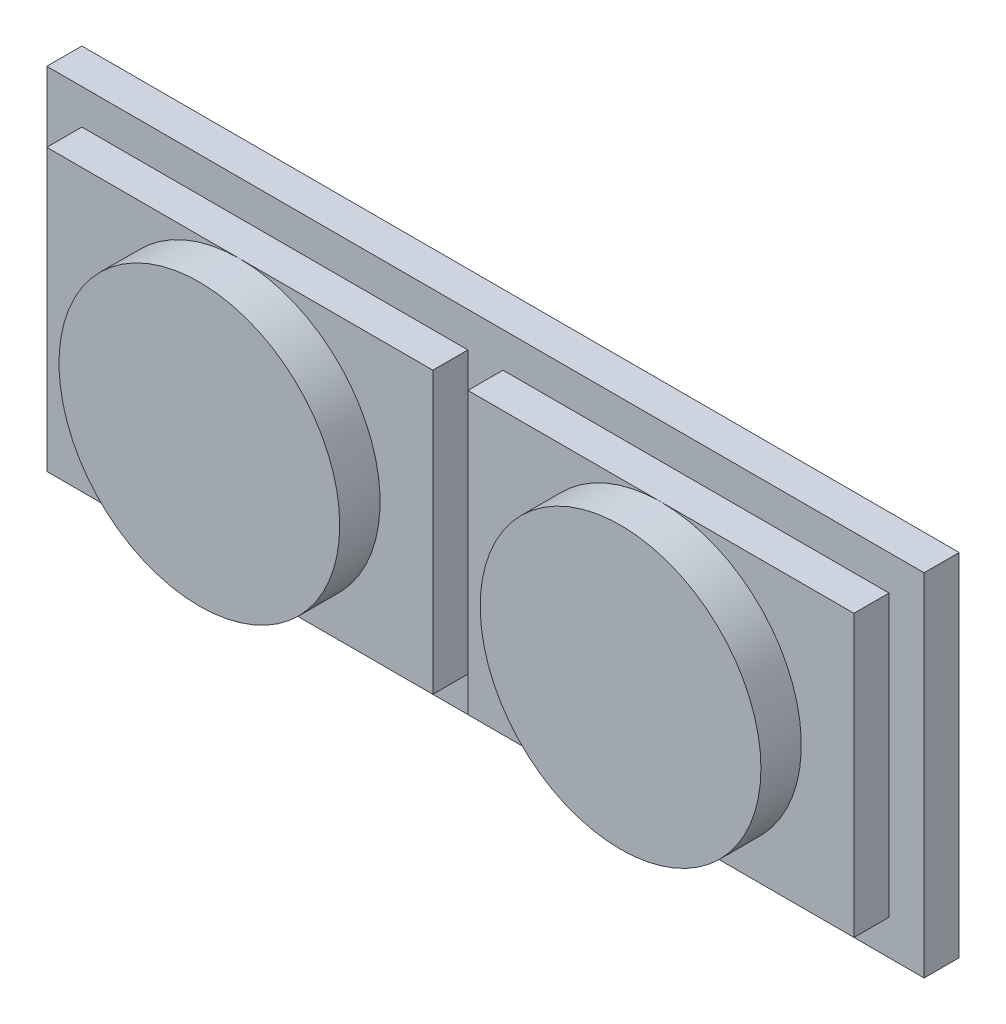
ISO-10303-21;
HEADER;
FILE_DESCRIPTION(('STEP AP214'),'2;1');
FILE_NAME('part.step','',(''),(''),'','','');
FILE_SCHEMA(('AUTOMOTIVE_DESIGN { 1 0 10303 214 1 1 1 1 }'));
ENDSEC;
DATA;
#1=APPLICATION_CONTEXT('core data for automotive mechanical design processes');
#2=APPLICATION_PROTOCOL_DEFINITION('international standard','automotive_design',2000,#1);
#3=PRODUCT_CONTEXT('',#1,'mechanical');
#4=PRODUCT('Part','Part','',(#3));
#5=PRODUCT_RELATED_PRODUCT_CATEGORY('part','',(#4));
#6=PRODUCT_DEFINITION_FORMATION('','',#4);
#7=PRODUCT_DEFINITION_CONTEXT('part definition',#1,'design');
#8=PRODUCT_DEFINITION('design','',#6,#7);
#9=PRODUCT_DEFINITION_SHAPE('','',#8);
#10=(LENGTH_UNIT() NAMED_UNIT(*) SI_UNIT(.MILLI.,.METRE.));
#11=(NAMED_UNIT(*) PLANE_ANGLE_UNIT() SI_UNIT($,.RADIAN.));
#12=(NAMED_UNIT(*) SI_UNIT($,.STERADIAN.) SOLID_ANGLE_UNIT());
#13=UNCERTAINTY_MEASURE_WITH_UNIT(LENGTH_MEASURE(1.E-05),#10,'distance_accuracy_value','');
#14=(GEOMETRIC_REPRESENTATION_CONTEXT(3) GLOBAL_UNCERTAINTY_ASSIGNED_CONTEXT((#13)) GLOBAL_UNIT_ASSIGNED_CONTEXT((#10,
#11,#12)) REPRESENTATION_CONTEXT('',''));
#15=CARTESIAN_POINT('',(0.,0.,0.));
#16=DIRECTION('',(0.,0.,1.));
#17=DIRECTION('',(1.,0.,0.));
#18=AXIS2_PLACEMENT_3D('',#15,#16,#17);
#19=CARTESIAN_POINT('',(0.,0.,0.508));
#20=DIRECTION('',(0.,0.,1.));
#21=DIRECTION('',(1.,0.,0.));
#22=AXIS2_PLACEMENT_3D('',#19,#20,#21);
#23=PLANE('',#22);
#24=CARTESIAN_POINT('',(4.699,1.27,0.508));
#25=DIRECTION('',(0.,0.,1.));
#26=DIRECTION('',(1.,0.,0.));
#27=AXIS2_PLACEMENT_3D('',#24,#25,#26);
#28=CIRCLE('',#27,1.016);
#29=CARTESIAN_POINT('',(4.699,2.286,0.508));
#30=VERTEX_POINT('',#29);
#31=CARTESIAN_POINT('',(4.699,0.254,0.508));
#32=VERTEX_POINT('',#31);
#33=EDGE_CURVE('E63',#30,#32,#28,.T.);
#34=ORIENTED_EDGE('',*,*,#33,.F.);
#35=DIRECTION('',(-1.,0.,0.));
#36=VECTOR('',#35,1.);
#37=CARTESIAN_POINT('',(6.096,2.286,0.508));
#38=LINE('',#37,#36);
#39=CARTESIAN_POINT('',(3.302,2.286,0.508));
#40=VERTEX_POINT('',#39);
#41=EDGE_CURVE('E111',#30,#40,#38,.T.);
#42=ORIENTED_EDGE('',*,*,#41,.T.);
#43=DIRECTION('',(0.,1.,0.));
#44=VECTOR('',#43,1.);
#45=CARTESIAN_POINT('',(3.302,0.254,0.508));
#46=LINE('',#45,#44);
#47=CARTESIAN_POINT('',(3.302,0.254,0.508));
#48=VERTEX_POINT('',#47);
#49=EDGE_CURVE('E121',#48,#40,#46,.T.);
#50=ORIENTED_EDGE('',*,*,#49,.F.);
#51=DIRECTION('',(1.,0.,0.));
#52=VECTOR('',#51,1.);
#53=CARTESIAN_POINT('',(3.302,0.254,0.508));
#54=LINE('',#53,#52);
#55=EDGE_CURVE('E56',#48,#32,#54,.T.);
#56=ORIENTED_EDGE('',*,*,#55,.T.);
#57=EDGE_LOOP('',(#34,#42,#50,#56));
#58=FACE_BOUND('',#57,.T.);
#59=ADVANCED_FACE('F52',(#58),#23,.T.);
#60=CARTESIAN_POINT('',(3.302,0.254,0.508));
#61=DIRECTION('',(0.,1.,0.));
#62=DIRECTION('',(0.,0.,1.));
#63=AXIS2_PLACEMENT_3D('',#60,#61,#62);
#64=PLANE('',#63);
#65=DIRECTION('',(1.,0.,0.));
#66=VECTOR('',#65,1.);
#67=CARTESIAN_POINT('',(3.302,0.254,0.254));
#68=LINE('',#67,#66);
#69=CARTESIAN_POINT('',(3.302,0.254,0.254));
#70=VERTEX_POINT('',#69);
#71=CARTESIAN_POINT('',(6.096,0.254,0.254));
#72=VERTEX_POINT('',#71);
#73=EDGE_CURVE('E61',#70,#72,#68,.T.);
#74=ORIENTED_EDGE('',*,*,#73,.T.);
#75=DIRECTION('',(0.,0.,-1.));
#76=VECTOR('',#75,1.);
#77=CARTESIAN_POINT('',(6.096,0.254,0.508));
#78=LINE('',#77,#76);
#79=CARTESIAN_POINT('',(6.096,0.254,0.508));
#80=VERTEX_POINT('',#79);
#81=EDGE_CURVE('E165',#80,#72,#78,.T.);
#82=ORIENTED_EDGE('',*,*,#81,.F.);
#83=EDGE_CURVE('E94',#32,#80,#54,.T.);
#84=ORIENTED_EDGE('',*,*,#83,.F.);
#85=ORIENTED_EDGE('',*,*,#55,.F.);
#86=DIRECTION('',(0.,0.,-1.));
#87=VECTOR('',#86,1.);
#88=CARTESIAN_POINT('',(3.302,0.254,0.508));
#89=LINE('',#88,#87);
#90=EDGE_CURVE('E101',#48,#70,#89,.T.);
#91=ORIENTED_EDGE('',*,*,#90,.T.);
#92=EDGE_LOOP('',(#74,#82,#84,#85,#91));
#93=FACE_BOUND('',#92,.T.);
#94=ADVANCED_FACE('F141',(#93),#64,.F.);
#95=CARTESIAN_POINT('',(6.096,0.254,0.508));
#96=DIRECTION('',(-1.,0.,0.));
#97=DIRECTION('',(0.,0.,1.));
#98=AXIS2_PLACEMENT_3D('',#95,#96,#97);
#99=PLANE('',#98);
#100=DIRECTION('',(0.,1.,0.));
#101=VECTOR('',#100,1.);
#102=CARTESIAN_POINT('',(6.096,0.254,0.254));
#103=LINE('',#102,#101);
#104=CARTESIAN_POINT('',(6.096,2.286,0.254));
#105=VERTEX_POINT('',#104);
#106=EDGE_CURVE('E77',#72,#105,#103,.T.);
#107=ORIENTED_EDGE('',*,*,#106,.T.);
#108=DIRECTION('',(0.,0.,-1.));
#109=VECTOR('',#108,1.);
#110=CARTESIAN_POINT('',(6.096,2.286,0.508));
#111=LINE('',#110,#109);
#112=CARTESIAN_POINT('',(6.096,2.286,0.508));
#113=VERTEX_POINT('',#112);
#114=EDGE_CURVE('E163',#113,#105,#111,.T.);
#115=ORIENTED_EDGE('',*,*,#114,.F.);
#116=DIRECTION('',(0.,1.,0.));
#117=VECTOR('',#116,1.);
#118=CARTESIAN_POINT('',(6.096,0.254,0.508));
#119=LINE('',#118,#117);
#120=EDGE_CURVE('E107',#80,#113,#119,.T.);
#121=ORIENTED_EDGE('',*,*,#120,.F.);
#122=ORIENTED_EDGE('',*,*,#81,.T.);
#123=EDGE_LOOP('',(#107,#115,#121,#122));
#124=FACE_BOUND('',#123,.T.);
#125=ADVANCED_FACE('F145',(#124),#99,.F.);
#126=CARTESIAN_POINT('',(6.096,2.286,0.508));
#127=DIRECTION('',(0.,-1.,0.));
#128=DIRECTION('',(0.,0.,-1.));
#129=AXIS2_PLACEMENT_3D('',#126,#127,#128);
#130=PLANE('',#129);
#131=DIRECTION('',(-1.,0.,0.));
#132=VECTOR('',#131,1.);
#133=CARTESIAN_POINT('',(6.096,2.286,0.254));
#134=LINE('',#133,#132);
#135=CARTESIAN_POINT('',(3.302,2.286,0.254));
#136=VERTEX_POINT('',#135);
#137=EDGE_CURVE('E166',#105,#136,#134,.T.);
#138=ORIENTED_EDGE('',*,*,#137,.T.);
#139=DIRECTION('',(0.,0.,-1.));
#140=VECTOR('',#139,1.);
#141=CARTESIAN_POINT('',(3.302,2.286,0.508));
#142=LINE('',#141,#140);
#143=EDGE_CURVE('E117',#40,#136,#142,.T.);
#144=ORIENTED_EDGE('',*,*,#143,.F.);
#145=ORIENTED_EDGE('',*,*,#41,.F.);
#146=EDGE_CURVE('E105',#113,#30,#38,.T.);
#147=ORIENTED_EDGE('',*,*,#146,.F.);
#148=ORIENTED_EDGE('',*,*,#114,.T.);
#149=EDGE_LOOP('',(#138,#144,#145,#147,#148));
#150=FACE_BOUND('',#149,.T.);
#151=ADVANCED_FACE('F116',(#150),#130,.F.);
#152=CARTESIAN_POINT('',(3.302,0.254,0.508));
#153=DIRECTION('',(-1.,0.,0.));
#154=DIRECTION('',(0.,0.,1.));
#155=AXIS2_PLACEMENT_3D('',#152,#153,#154);
#156=PLANE('',#155);
#157=DIRECTION('',(0.,1.,0.));
#158=VECTOR('',#157,1.);
#159=CARTESIAN_POINT('',(3.302,0.254,0.254));
#160=LINE('',#159,#158);
#161=EDGE_CURVE('E170',#70,#136,#160,.T.);
#162=ORIENTED_EDGE('',*,*,#161,.F.);
#163=ORIENTED_EDGE('',*,*,#90,.F.);
#164=ORIENTED_EDGE('',*,*,#49,.T.);
#165=ORIENTED_EDGE('',*,*,#143,.T.);
#166=EDGE_LOOP('',(#162,#163,#164,#165));
#167=FACE_BOUND('',#166,.T.);
#168=ADVANCED_FACE('F147',(#167),#156,.T.);
#169=EDGE_CURVE('E12',#32,#30,#28,.T.);
#170=ORIENTED_EDGE('',*,*,#169,.F.);
#171=ORIENTED_EDGE('',*,*,#83,.T.);
#172=ORIENTED_EDGE('',*,*,#120,.T.);
#173=ORIENTED_EDGE('',*,*,#146,.T.);
#174=EDGE_LOOP('',(#170,#171,#172,#173));
#175=FACE_BOUND('',#174,.T.);
#176=ADVANCED_FACE('F54',(#175),#23,.T.);
#177=CARTESIAN_POINT('',(0.,0.,0.254));
#178=DIRECTION('',(0.,0.,1.));
#179=DIRECTION('',(1.,0.,0.));
#180=AXIS2_PLACEMENT_3D('',#177,#178,#179);
#181=PLANE('',#180);
#182=ORIENTED_EDGE('',*,*,#73,.F.);
#183=ORIENTED_EDGE('',*,*,#161,.T.);
#184=ORIENTED_EDGE('',*,*,#137,.F.);
#185=ORIENTED_EDGE('',*,*,#106,.F.);
#186=EDGE_LOOP('',(#182,#183,#184,#185));
#187=FACE_BOUND('',#186,.T.);
#188=ADVANCED_FACE('F129',(#187),#181,.F.);
#189=CARTESIAN_POINT('',(4.699,1.27,0.8001));
#190=DIRECTION('',(0.,0.,-1.));
#191=DIRECTION('',(-1.,0.,0.));
#192=AXIS2_PLACEMENT_3D('',#189,#190,#191);
#193=CYLINDRICAL_SURFACE('',#192,1.016);
#194=CARTESIAN_POINT('',(4.699,1.27,0.8001));
#195=DIRECTION('',(0.,0.,1.));
#196=DIRECTION('',(1.,0.,0.));
#197=AXIS2_PLACEMENT_3D('',#194,#195,#196);
#198=CIRCLE('',#197,1.016);
#199=CARTESIAN_POINT('',(5.715,1.27,0.8001));
#200=VERTEX_POINT('',#199);
#201=EDGE_CURVE('E125',#200,#200,#198,.T.);
#202=ORIENTED_EDGE('',*,*,#201,.F.);
#203=EDGE_LOOP('',(#202));
#204=FACE_BOUND('',#203,.T.);
#205=ORIENTED_EDGE('',*,*,#33,.T.);
#206=ORIENTED_EDGE('',*,*,#169,.T.);
#207=EDGE_LOOP('',(#205,#206));
#208=FACE_BOUND('',#207,.T.);
#209=ADVANCED_FACE('F126',(#204,#208),#193,.T.);
#210=CARTESIAN_POINT('',(4.699,1.27,0.8001));
#211=DIRECTION('',(0.,0.,1.));
#212=DIRECTION('',(1.,0.,0.));
#213=AXIS2_PLACEMENT_3D('',#210,#211,#212);
#214=PLANE('',#213);
#215=ORIENTED_EDGE('',*,*,#201,.T.);
#216=EDGE_LOOP('',(#215));
#217=FACE_BOUND('',#216,.T.);
#218=ADVANCED_FACE('F128',(#217),#214,.T.);
#219=CLOSED_SHELL('',(#59,#94,#125,#151,#168,#176,#188,#209,#218));
#220=MANIFOLD_SOLID_BREP('B2',#219);
#221=CARTESIAN_POINT('',(0.,0.,0.508));
#222=DIRECTION('',(0.,0.,-1.));
#223=DIRECTION('',(-1.,0.,0.));
#224=AXIS2_PLACEMENT_3D('',#221,#222,#223);
#225=PLANE('',#224);
#226=CARTESIAN_POINT('',(1.65039021897422,1.27,0.508));
#227=DIRECTION('',(0.,0.,1.));
#228=DIRECTION('',(1.,0.,0.));
#229=AXIS2_PLACEMENT_3D('',#226,#227,#228);
#230=CIRCLE('',#229,1.016);
#231=CARTESIAN_POINT('',(1.65039021897422,2.286,0.508));
#232=VERTEX_POINT('',#231);
#233=CARTESIAN_POINT('',(1.65039021897422,0.254,0.508));
#234=VERTEX_POINT('',#233);
#235=EDGE_CURVE('E259',#232,#234,#230,.T.);
#236=ORIENTED_EDGE('',*,*,#235,.F.);
#237=DIRECTION('',(1.,0.,0.));
#238=VECTOR('',#237,1.);
#239=CARTESIAN_POINT('',(0.254,2.286,0.508));
#240=LINE('',#239,#238);
#241=CARTESIAN_POINT('',(0.254,2.286,0.508));
#242=VERTEX_POINT('',#241);
#243=EDGE_CURVE('E300',#242,#232,#240,.T.);
#244=ORIENTED_EDGE('',*,*,#243,.F.);
#245=DIRECTION('',(0.,1.,0.));
#246=VECTOR('',#245,1.);
#247=CARTESIAN_POINT('',(0.254,0.254,0.508));
#248=LINE('',#247,#246);
#249=CARTESIAN_POINT('',(0.254,0.254,0.508));
#250=VERTEX_POINT('',#249);
#251=EDGE_CURVE('E312',#250,#242,#248,.T.);
#252=ORIENTED_EDGE('',*,*,#251,.F.);
#253=DIRECTION('',(1.,0.,0.));
#254=VECTOR('',#253,1.);
#255=CARTESIAN_POINT('',(0.254,0.254,0.508));
#256=LINE('',#255,#254);
#257=EDGE_CURVE('E315',#250,#234,#256,.T.);
#258=ORIENTED_EDGE('',*,*,#257,.T.);
#259=EDGE_LOOP('',(#236,#244,#252,#258));
#260=FACE_BOUND('',#259,.T.);
#261=ADVANCED_FACE('F248',(#260),#225,.F.);
#262=CARTESIAN_POINT('',(0.254,0.254,0.508));
#263=DIRECTION('',(-1.,0.,0.));
#264=DIRECTION('',(0.,0.,1.));
#265=AXIS2_PLACEMENT_3D('',#262,#263,#264);
#266=PLANE('',#265);
#267=DIRECTION('',(0.,1.,0.));
#268=VECTOR('',#267,1.);
#269=CARTESIAN_POINT('',(0.254,0.254,0.254));
#270=LINE('',#269,#268);
#271=CARTESIAN_POINT('',(0.254,0.254,0.254));
#272=VERTEX_POINT('',#271);
#273=CARTESIAN_POINT('',(0.254,2.286,0.254));
#274=VERTEX_POINT('',#273);
#275=EDGE_CURVE('E364',#272,#274,#270,.T.);
#276=ORIENTED_EDGE('',*,*,#275,.F.);
#277=DIRECTION('',(0.,0.,-1.));
#278=VECTOR('',#277,1.);
#279=CARTESIAN_POINT('',(0.254,0.254,0.508));
#280=LINE('',#279,#278);
#281=EDGE_CURVE('E257',#250,#272,#280,.T.);
#282=ORIENTED_EDGE('',*,*,#281,.F.);
#283=ORIENTED_EDGE('',*,*,#251,.T.);
#284=DIRECTION('',(0.,0.,-1.));
#285=VECTOR('',#284,1.);
#286=CARTESIAN_POINT('',(0.254,2.286,0.508));
#287=LINE('',#286,#285);
#288=EDGE_CURVE('E252',#242,#274,#287,.T.);
#289=ORIENTED_EDGE('',*,*,#288,.T.);
#290=EDGE_LOOP('',(#276,#282,#283,#289));
#291=FACE_BOUND('',#290,.T.);
#292=ADVANCED_FACE('F250',(#291),#266,.T.);
#293=CARTESIAN_POINT('',(0.254,0.254,0.508));
#294=DIRECTION('',(0.,1.,0.));
#295=DIRECTION('',(0.,0.,1.));
#296=AXIS2_PLACEMENT_3D('',#293,#294,#295);
#297=PLANE('',#296);
#298=DIRECTION('',(1.,0.,0.));
#299=VECTOR('',#298,1.);
#300=CARTESIAN_POINT('',(0.254,0.254,0.254));
#301=LINE('',#300,#299);
#302=CARTESIAN_POINT('',(3.048,0.254,0.254));
#303=VERTEX_POINT('',#302);
#304=EDGE_CURVE('E354',#272,#303,#301,.T.);
#305=ORIENTED_EDGE('',*,*,#304,.T.);
#306=DIRECTION('',(0.,0.,-1.));
#307=VECTOR('',#306,1.);
#308=CARTESIAN_POINT('',(3.048,0.254,0.508));
#309=LINE('',#308,#307);
#310=CARTESIAN_POINT('',(3.048,0.254,0.508));
#311=VERTEX_POINT('',#310);
#312=EDGE_CURVE('E356',#311,#303,#309,.T.);
#313=ORIENTED_EDGE('',*,*,#312,.F.);
#314=EDGE_CURVE('E370',#234,#311,#256,.T.);
#315=ORIENTED_EDGE('',*,*,#314,.F.);
#316=ORIENTED_EDGE('',*,*,#257,.F.);
#317=ORIENTED_EDGE('',*,*,#281,.T.);
#318=EDGE_LOOP('',(#305,#313,#315,#316,#317));
#319=FACE_BOUND('',#318,.T.);
#320=ADVANCED_FACE('F338',(#319),#297,.F.);
#321=CARTESIAN_POINT('',(3.048,2.286,0.508));
#322=DIRECTION('',(1.,0.,0.));
#323=DIRECTION('',(0.,0.,-1.));
#324=AXIS2_PLACEMENT_3D('',#321,#322,#323);
#325=PLANE('',#324);
#326=DIRECTION('',(0.,-1.,0.));
#327=VECTOR('',#326,1.);
#328=CARTESIAN_POINT('',(3.048,2.286,0.254));
#329=LINE('',#328,#327);
#330=CARTESIAN_POINT('',(3.048,2.286,0.254));
#331=VERTEX_POINT('',#330);
#332=EDGE_CURVE('E358',#331,#303,#329,.T.);
#333=ORIENTED_EDGE('',*,*,#332,.F.);
#334=DIRECTION('',(0.,0.,-1.));
#335=VECTOR('',#334,1.);
#336=CARTESIAN_POINT('',(3.048,2.286,0.508));
#337=LINE('',#336,#335);
#338=CARTESIAN_POINT('',(3.048,2.286,0.508));
#339=VERTEX_POINT('',#338);
#340=EDGE_CURVE('E369',#339,#331,#337,.T.);
#341=ORIENTED_EDGE('',*,*,#340,.F.);
#342=DIRECTION('',(0.,-1.,0.));
#343=VECTOR('',#342,1.);
#344=CARTESIAN_POINT('',(3.048,2.286,0.508));
#345=LINE('',#344,#343);
#346=EDGE_CURVE('E307',#339,#311,#345,.T.);
#347=ORIENTED_EDGE('',*,*,#346,.T.);
#348=ORIENTED_EDGE('',*,*,#312,.T.);
#349=EDGE_LOOP('',(#333,#341,#347,#348));
#350=FACE_BOUND('',#349,.T.);
#351=ADVANCED_FACE('F343',(#350),#325,.T.);
#352=CARTESIAN_POINT('',(0.254,2.286,0.508));
#353=DIRECTION('',(0.,1.,0.));
#354=DIRECTION('',(0.,0.,1.));
#355=AXIS2_PLACEMENT_3D('',#352,#353,#354);
#356=PLANE('',#355);
#357=DIRECTION('',(1.,0.,0.));
#358=VECTOR('',#357,1.);
#359=CARTESIAN_POINT('',(0.254,2.286,0.254));
#360=LINE('',#359,#358);
#361=EDGE_CURVE('E362',#274,#331,#360,.T.);
#362=ORIENTED_EDGE('',*,*,#361,.F.);
#363=ORIENTED_EDGE('',*,*,#288,.F.);
#364=ORIENTED_EDGE('',*,*,#243,.T.);
#365=EDGE_CURVE('E302',#232,#339,#240,.T.);
#366=ORIENTED_EDGE('',*,*,#365,.T.);
#367=ORIENTED_EDGE('',*,*,#340,.T.);
#368=EDGE_LOOP('',(#362,#363,#364,#366,#367));
#369=FACE_BOUND('',#368,.T.);
#370=ADVANCED_FACE('F301',(#369),#356,.T.);
#371=EDGE_CURVE('E50',#234,#232,#230,.T.);
#372=ORIENTED_EDGE('',*,*,#371,.F.);
#373=ORIENTED_EDGE('',*,*,#314,.T.);
#374=ORIENTED_EDGE('',*,*,#346,.F.);
#375=ORIENTED_EDGE('',*,*,#365,.F.);
#376=EDGE_LOOP('',(#372,#373,#374,#375));
#377=FACE_BOUND('',#376,.T.);
#378=ADVANCED_FACE('F310',(#377),#225,.F.);
#379=CARTESIAN_POINT('',(0.,0.,0.254));
#380=DIRECTION('',(0.,0.,-1.));
#381=DIRECTION('',(-1.,0.,0.));
#382=AXIS2_PLACEMENT_3D('',#379,#380,#381);
#383=PLANE('',#382);
#384=ORIENTED_EDGE('',*,*,#275,.T.);
#385=ORIENTED_EDGE('',*,*,#361,.T.);
#386=ORIENTED_EDGE('',*,*,#332,.T.);
#387=ORIENTED_EDGE('',*,*,#304,.F.);
#388=EDGE_LOOP('',(#384,#385,#386,#387));
#389=FACE_BOUND('',#388,.T.);
#390=ADVANCED_FACE('F321',(#389),#383,.T.);
#391=CARTESIAN_POINT('',(1.65039021897422,1.27,0.8001));
#392=DIRECTION('',(0.,0.,-1.));
#393=DIRECTION('',(-1.,0.,0.));
#394=AXIS2_PLACEMENT_3D('',#391,#392,#393);
#395=CYLINDRICAL_SURFACE('',#394,1.016);
#396=CARTESIAN_POINT('',(1.65039021897422,1.27,0.8001));
#397=DIRECTION('',(0.,0.,1.));
#398=DIRECTION('',(1.,0.,0.));
#399=AXIS2_PLACEMENT_3D('',#396,#397,#398);
#400=CIRCLE('',#399,1.016);
#401=CARTESIAN_POINT('',(2.66639021897422,1.27,0.8001));
#402=VERTEX_POINT('',#401);
#403=EDGE_CURVE('E317',#402,#402,#400,.T.);
#404=ORIENTED_EDGE('',*,*,#403,.F.);
#405=EDGE_LOOP('',(#404));
#406=FACE_BOUND('',#405,.T.);
#407=ORIENTED_EDGE('',*,*,#235,.T.);
#408=ORIENTED_EDGE('',*,*,#371,.T.);
#409=EDGE_LOOP('',(#407,#408));
#410=FACE_BOUND('',#409,.T.);
#411=ADVANCED_FACE('F318',(#406,#410),#395,.T.);
#412=CARTESIAN_POINT('',(1.65039021897422,1.27,0.8001));
#413=DIRECTION('',(0.,0.,1.));
#414=DIRECTION('',(1.,0.,0.));
#415=AXIS2_PLACEMENT_3D('',#412,#413,#414);
#416=PLANE('',#415);
#417=ORIENTED_EDGE('',*,*,#403,.T.);
#418=EDGE_LOOP('',(#417));
#419=FACE_BOUND('',#418,.T.);
#420=ADVANCED_FACE('F320',(#419),#416,.T.);
#421=CLOSED_SHELL('',(#261,#292,#320,#351,#370,#378,#390,#411,#420));
#422=MANIFOLD_SOLID_BREP('B6',#421);
#423=CARTESIAN_POINT('',(0.,0.,0.254));
#424=DIRECTION('',(1.,0.,0.));
#425=DIRECTION('',(0.,1.,0.));
#426=AXIS2_PLACEMENT_3D('',#423,#424,#425);
#427=PLANE('',#426);
#428=DIRECTION('',(0.,-1.,0.));
#429=VECTOR('',#428,1.);
#430=CARTESIAN_POINT('',(0.,0.,0.));
#431=LINE('',#430,#429);
#432=CARTESIAN_POINT('',(0.,2.54,0.));
#433=VERTEX_POINT('',#432);
#434=CARTESIAN_POINT('',(0.,0.,0.));
#435=VERTEX_POINT('',#434);
#436=EDGE_CURVE('E503',#433,#435,#431,.T.);
#437=ORIENTED_EDGE('',*,*,#436,.T.);
#438=DIRECTION('',(0.,0.,-1.));
#439=VECTOR('',#438,1.);
#440=CARTESIAN_POINT('',(0.,0.,0.254));
#441=LINE('',#440,#439);
#442=CARTESIAN_POINT('',(0.,0.,0.254));
#443=VERTEX_POINT('',#442);
#444=EDGE_CURVE('E246',#443,#435,#441,.T.);
#445=ORIENTED_EDGE('',*,*,#444,.F.);
#446=DIRECTION('',(0.,-1.,0.));
#447=VECTOR('',#446,1.);
#448=CARTESIAN_POINT('',(0.,0.,0.254));
#449=LINE('',#448,#447);
#450=CARTESIAN_POINT('',(0.,2.54,0.254));
#451=VERTEX_POINT('',#450);
#452=EDGE_CURVE('E487',#451,#443,#449,.T.);
#453=ORIENTED_EDGE('',*,*,#452,.F.);
#454=DIRECTION('',(0.,0.,-1.));
#455=VECTOR('',#454,1.);
#456=CARTESIAN_POINT('',(0.,2.54,0.254));
#457=LINE('',#456,#455);
#458=EDGE_CURVE('E499',#451,#433,#457,.T.);
#459=ORIENTED_EDGE('',*,*,#458,.T.);
#460=EDGE_LOOP('',(#437,#445,#453,#459));
#461=FACE_BOUND('',#460,.T.);
#462=ADVANCED_FACE('F435',(#461),#427,.F.);
#463=CARTESIAN_POINT('',(0.,0.,0.254));
#464=DIRECTION('',(0.,1.,0.));
#465=DIRECTION('',(0.,0.,1.));
#466=AXIS2_PLACEMENT_3D('',#463,#464,#465);
#467=PLANE('',#466);
#468=DIRECTION('',(1.,0.,0.));
#469=VECTOR('',#468,1.);
#470=CARTESIAN_POINT('',(0.,0.,0.));
#471=LINE('',#470,#469);
#472=CARTESIAN_POINT('',(6.35,0.,0.));
#473=VERTEX_POINT('',#472);
#474=EDGE_CURVE('E492',#435,#473,#471,.T.);
#475=ORIENTED_EDGE('',*,*,#474,.T.);
#476=DIRECTION('',(0.,0.,-1.));
#477=VECTOR('',#476,1.);
#478=CARTESIAN_POINT('',(6.35,0.,0.254));
#479=LINE('',#478,#477);
#480=CARTESIAN_POINT('',(6.35,0.,0.254));
#481=VERTEX_POINT('',#480);
#482=EDGE_CURVE('E444',#481,#473,#479,.T.);
#483=ORIENTED_EDGE('',*,*,#482,.F.);
#484=DIRECTION('',(1.,0.,0.));
#485=VECTOR('',#484,1.);
#486=CARTESIAN_POINT('',(0.,0.,0.254));
#487=LINE('',#486,#485);
#488=EDGE_CURVE('E482',#443,#481,#487,.T.);
#489=ORIENTED_EDGE('',*,*,#488,.F.);
#490=ORIENTED_EDGE('',*,*,#444,.T.);
#491=EDGE_LOOP('',(#475,#483,#489,#490));
#492=FACE_BOUND('',#491,.T.);
#493=ADVANCED_FACE('F491',(#492),#467,.F.);
#494=CARTESIAN_POINT('',(6.35,0.,0.254));
#495=DIRECTION('',(-1.,0.,0.));
#496=DIRECTION('',(0.,-1.,0.));
#497=AXIS2_PLACEMENT_3D('',#494,#495,#496);
#498=PLANE('',#497);
#499=DIRECTION('',(0.,1.,0.));
#500=VECTOR('',#499,1.);
#501=CARTESIAN_POINT('',(6.35,0.,0.));
#502=LINE('',#501,#500);
#503=CARTESIAN_POINT('',(6.35,2.54,0.));
#504=VERTEX_POINT('',#503);
#505=EDGE_CURVE('E469',#473,#504,#502,.T.);
#506=ORIENTED_EDGE('',*,*,#505,.T.);
#507=DIRECTION('',(0.,0.,-1.));
#508=VECTOR('',#507,1.);
#509=CARTESIAN_POINT('',(6.35,2.54,0.254));
#510=LINE('',#509,#508);
#511=CARTESIAN_POINT('',(6.35,2.54,0.254));
#512=VERTEX_POINT('',#511);
#513=EDGE_CURVE('E494',#512,#504,#510,.T.);
#514=ORIENTED_EDGE('',*,*,#513,.F.);
#515=DIRECTION('',(0.,1.,0.));
#516=VECTOR('',#515,1.);
#517=CARTESIAN_POINT('',(6.35,0.,0.254));
#518=LINE('',#517,#516);
#519=EDGE_CURVE('E485',#481,#512,#518,.T.);
#520=ORIENTED_EDGE('',*,*,#519,.F.);
#521=ORIENTED_EDGE('',*,*,#482,.T.);
#522=EDGE_LOOP('',(#506,#514,#520,#521));
#523=FACE_BOUND('',#522,.T.);
#524=ADVANCED_FACE('F495',(#523),#498,.F.);
#525=CARTESIAN_POINT('',(0.,2.54,0.254));
#526=DIRECTION('',(0.,-1.,0.));
#527=DIRECTION('',(0.,0.,-1.));
#528=AXIS2_PLACEMENT_3D('',#525,#526,#527);
#529=PLANE('',#528);
#530=DIRECTION('',(-1.,0.,0.));
#531=VECTOR('',#530,1.);
#532=CARTESIAN_POINT('',(0.,2.54,0.));
#533=LINE('',#532,#531);
#534=EDGE_CURVE('E475',#504,#433,#533,.T.);
#535=ORIENTED_EDGE('',*,*,#534,.T.);
#536=ORIENTED_EDGE('',*,*,#458,.F.);
#537=DIRECTION('',(-1.,0.,0.));
#538=VECTOR('',#537,1.);
#539=CARTESIAN_POINT('',(0.,2.54,0.254));
#540=LINE('',#539,#538);
#541=EDGE_CURVE('E452',#512,#451,#540,.T.);
#542=ORIENTED_EDGE('',*,*,#541,.F.);
#543=ORIENTED_EDGE('',*,*,#513,.T.);
#544=EDGE_LOOP('',(#535,#536,#542,#543));
#545=FACE_BOUND('',#544,.T.);
#546=ADVANCED_FACE('F516',(#545),#529,.F.);
#547=CARTESIAN_POINT('',(0.,0.,0.254));
#548=DIRECTION('',(0.,0.,-1.));
#549=DIRECTION('',(-1.,0.,0.));
#550=AXIS2_PLACEMENT_3D('',#547,#548,#549);
#551=PLANE('',#550);
#552=ORIENTED_EDGE('',*,*,#452,.T.);
#553=ORIENTED_EDGE('',*,*,#488,.T.);
#554=ORIENTED_EDGE('',*,*,#519,.T.);
#555=ORIENTED_EDGE('',*,*,#541,.T.);
#556=EDGE_LOOP('',(#552,#553,#554,#555));
#557=FACE_BOUND('',#556,.T.);
#558=ADVANCED_FACE('F483',(#557),#551,.F.);
#559=CARTESIAN_POINT('',(0.,0.,0.));
#560=DIRECTION('',(0.,0.,-1.));
#561=DIRECTION('',(-1.,0.,0.));
#562=AXIS2_PLACEMENT_3D('',#559,#560,#561);
#563=PLANE('',#562);
#564=ORIENTED_EDGE('',*,*,#436,.F.);
#565=ORIENTED_EDGE('',*,*,#534,.F.);
#566=ORIENTED_EDGE('',*,*,#505,.F.);
#567=ORIENTED_EDGE('',*,*,#474,.F.);
#568=EDGE_LOOP('',(#564,#565,#566,#567));
#569=FACE_BOUND('',#568,.T.);
#570=ADVANCED_FACE('F519',(#569),#563,.T.);
#571=CLOSED_SHELL('',(#462,#493,#524,#546,#558,#570));
#572=MANIFOLD_SOLID_BREP('B44',#571);
#573=ADVANCED_BREP_SHAPE_REPRESENTATION('',(#18,#220,#422,#572),#14);
#574=SHAPE_DEFINITION_REPRESENTATION(#9,#573);
ENDSEC;
END-ISO-10303-21;
